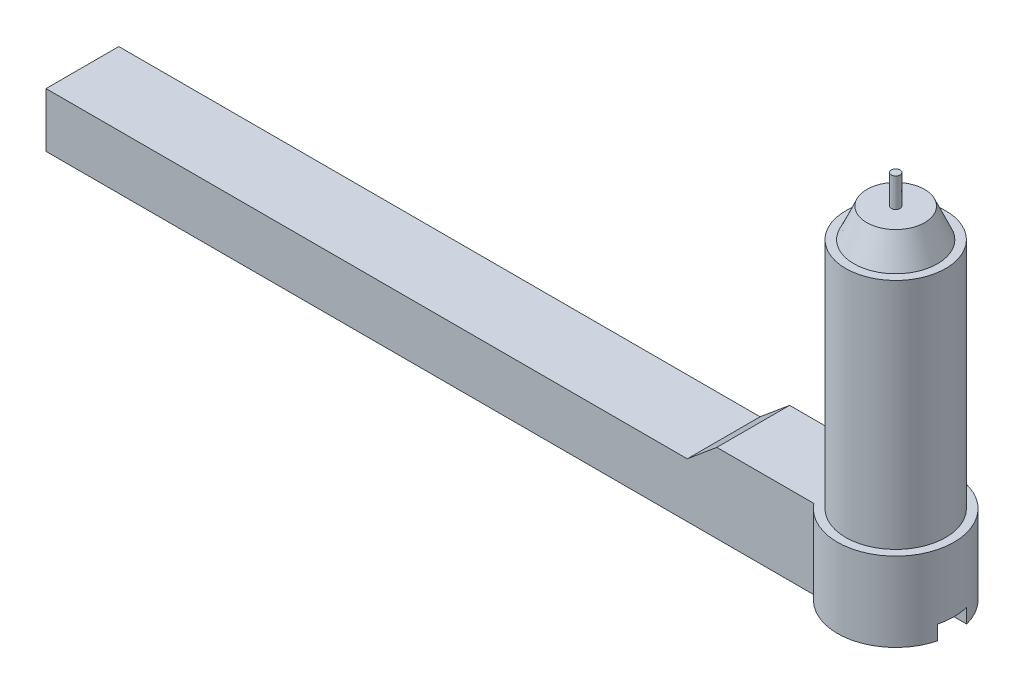
ISO-10303-21;
HEADER;
FILE_DESCRIPTION(('STEP AP214'),'2;1');
FILE_NAME('part.step','',(''),(''),'','','');
FILE_SCHEMA(('AUTOMOTIVE_DESIGN { 1 0 10303 214 1 1 1 1 }'));
ENDSEC;
DATA;
#1=APPLICATION_CONTEXT('core data for automotive mechanical design processes');
#2=APPLICATION_PROTOCOL_DEFINITION('international standard','automotive_design',2000,#1);
#3=PRODUCT_CONTEXT('',#1,'mechanical');
#4=PRODUCT('Part','Part','',(#3));
#5=PRODUCT_RELATED_PRODUCT_CATEGORY('part','',(#4));
#6=PRODUCT_DEFINITION_FORMATION('','',#4);
#7=PRODUCT_DEFINITION_CONTEXT('part definition',#1,'design');
#8=PRODUCT_DEFINITION('design','',#6,#7);
#9=PRODUCT_DEFINITION_SHAPE('','',#8);
#10=(LENGTH_UNIT() NAMED_UNIT(*) SI_UNIT(.MILLI.,.METRE.));
#11=(NAMED_UNIT(*) PLANE_ANGLE_UNIT() SI_UNIT($,.RADIAN.));
#12=(NAMED_UNIT(*) SI_UNIT($,.STERADIAN.) SOLID_ANGLE_UNIT());
#13=UNCERTAINTY_MEASURE_WITH_UNIT(LENGTH_MEASURE(1.E-05),#10,'distance_accuracy_value','');
#14=(GEOMETRIC_REPRESENTATION_CONTEXT(3) GLOBAL_UNCERTAINTY_ASSIGNED_CONTEXT((#13)) GLOBAL_UNIT_ASSIGNED_CONTEXT((#10,
#11,#12)) REPRESENTATION_CONTEXT('',''));
#15=CARTESIAN_POINT('',(0.,0.,0.));
#16=DIRECTION('',(0.,0.,1.));
#17=DIRECTION('',(1.,0.,0.));
#18=AXIS2_PLACEMENT_3D('',#15,#16,#17);
#19=CARTESIAN_POINT('',(-42.6478722443733,9.,-3.80623917297608));
#20=DIRECTION('',(1.,0.,0.));
#21=DIRECTION('',(0.,0.,-1.));
#22=AXIS2_PLACEMENT_3D('',#19,#20,#21);
#23=PLANE('',#22);
#24=DIRECTION('',(0.,-1.,0.));
#25=VECTOR('',#24,1.);
#26=CARTESIAN_POINT('',(-42.6478722443733,9.,-3.80623917297608));
#27=LINE('',#26,#25);
#28=CARTESIAN_POINT('',(-42.6478722443733,7.30493676232652,-3.80623917297608));
#29=VERTEX_POINT('',#28);
#30=CARTESIAN_POINT('',(-42.6478722443733,3.56782360118036,-3.80623917297608));
#31=VERTEX_POINT('',#30);
#32=EDGE_CURVE('E193',#29,#31,#27,.T.);
#33=ORIENTED_EDGE('',*,*,#32,.T.);
#34=DIRECTION('',(0.,0.,1.));
#35=VECTOR('',#34,1.);
#36=CARTESIAN_POINT('',(-42.6478722443733,3.56782360118036,-5.30623917297608));
#37=LINE('',#36,#35);
#38=CARTESIAN_POINT('',(-42.6478722443733,3.56782360118036,1.19376082702392));
#39=VERTEX_POINT('',#38);
#40=EDGE_CURVE('E56',#31,#39,#37,.T.);
#41=ORIENTED_EDGE('',*,*,#40,.T.);
#42=DIRECTION('',(0.,-1.,0.));
#43=VECTOR('',#42,1.);
#44=CARTESIAN_POINT('',(-42.6478722443733,9.,1.19376082702392));
#45=LINE('',#44,#43);
#46=CARTESIAN_POINT('',(-42.6478722443733,7.30493676232652,1.19376082702392));
#47=VERTEX_POINT('',#46);
#48=EDGE_CURVE('E202',#47,#39,#45,.T.);
#49=ORIENTED_EDGE('',*,*,#48,.F.);
#50=DIRECTION('',(0.,0.,1.));
#51=VECTOR('',#50,1.);
#52=CARTESIAN_POINT('',(-42.6478722443733,7.30493676232652,-4.80623917297608));
#53=LINE('',#52,#51);
#54=EDGE_CURVE('E179',#29,#47,#53,.T.);
#55=ORIENTED_EDGE('',*,*,#54,.F.);
#56=EDGE_LOOP('',(#33,#41,#49,#55));
#57=FACE_BOUND('',#56,.T.);
#58=ADVANCED_FACE('F34',(#57),#23,.F.);
#59=CARTESIAN_POINT('',(-42.6478722443733,9.,1.19376082702392));
#60=DIRECTION('',(0.,0.,-1.));
#61=DIRECTION('',(-1.,0.,0.));
#62=AXIS2_PLACEMENT_3D('',#59,#60,#61);
#63=PLANE('',#62);
#64=ORIENTED_EDGE('',*,*,#48,.T.);
#65=DIRECTION('',(1.,0.,0.));
#66=VECTOR('',#65,1.);
#67=CARTESIAN_POINT('',(-42.6478722443733,3.56782360118036,1.19376082702392));
#68=LINE('',#67,#66);
#69=CARTESIAN_POINT('',(10.0914698488453,3.56782360118036,1.19376082702392));
#70=VERTEX_POINT('',#69);
#71=EDGE_CURVE('E152',#39,#70,#68,.T.);
#72=ORIENTED_EDGE('',*,*,#71,.T.);
#73=DIRECTION('',(0.,-1.,0.));
#74=VECTOR('',#73,1.);
#75=CARTESIAN_POINT('',(10.0914698488453,9.,1.19376082702392));
#76=LINE('',#75,#74);
#77=CARTESIAN_POINT('',(10.0914698488453,9.,1.19376082702392));
#78=VERTEX_POINT('',#77);
#79=EDGE_CURVE('E199',#78,#70,#76,.T.);
#80=ORIENTED_EDGE('',*,*,#79,.F.);
#81=DIRECTION('',(1.,0.,0.));
#82=VECTOR('',#81,1.);
#83=CARTESIAN_POINT('',(-42.6478722443733,9.,1.19376082702392));
#84=LINE('',#83,#82);
#85=CARTESIAN_POINT('',(3.42658005695919,9.,1.19376082702392));
#86=VERTEX_POINT('',#85);
#87=EDGE_CURVE('E186',#86,#78,#84,.T.);
#88=ORIENTED_EDGE('',*,*,#87,.F.);
#89=DIRECTION('',(0.767367056910445,0.641208078527244,0.));
#90=VECTOR('',#89,1.);
#91=CARTESIAN_POINT('',(1.39800971991949,7.30493676232652,1.19376082702392));
#92=LINE('',#91,#90);
#93=CARTESIAN_POINT('',(1.39800971991949,7.30493676232652,1.19376082702392));
#94=VERTEX_POINT('',#93);
#95=EDGE_CURVE('E177',#94,#86,#92,.T.);
#96=ORIENTED_EDGE('',*,*,#95,.F.);
#97=DIRECTION('',(1.,0.,0.));
#98=VECTOR('',#97,1.);
#99=CARTESIAN_POINT('',(-42.6478722443733,7.30493676232652,1.19376082702392));
#100=LINE('',#99,#98);
#101=EDGE_CURVE('E171',#47,#94,#100,.T.);
#102=ORIENTED_EDGE('',*,*,#101,.F.);
#103=EDGE_LOOP('',(#64,#72,#80,#88,#96,#102));
#104=FACE_BOUND('',#103,.T.);
#105=ADVANCED_FACE('F222',(#104),#63,.F.);
#106=CARTESIAN_POINT('',(13.2139688480445,9.,-1.30623917297608));
#107=DIRECTION('',(0.,-1.,0.));
#108=DIRECTION('',(0.,0.,-1.));
#109=AXIS2_PLACEMENT_3D('',#106,#107,#108);
#110=CYLINDRICAL_SURFACE('',#109,4.);
#111=CARTESIAN_POINT('',(13.2139688480445,3.56782360118036,-1.30623917297608));
#112=DIRECTION('',(0.,1.,0.));
#113=DIRECTION('',(0.,0.,1.));
#114=AXIS2_PLACEMENT_3D('',#111,#112,#113);
#115=CIRCLE('',#114,4.);
#116=CARTESIAN_POINT('',(17.0869521942519,3.56782360118036,-0.306239172976082));
#117=VERTEX_POINT('',#116);
#118=EDGE_CURVE('E149',#70,#117,#115,.T.);
#119=ORIENTED_EDGE('',*,*,#118,.T.);
#120=DIRECTION('',(0.,-1.,0.));
#121=VECTOR('',#120,1.);
#122=CARTESIAN_POINT('',(17.0869521942519,9.,-0.306239172976082));
#123=LINE('',#122,#121);
#124=CARTESIAN_POINT('',(17.0869521942519,4.56782360118036,-0.306239172976082));
#125=VERTEX_POINT('',#124);
#126=EDGE_CURVE('E139',#117,#125,#123,.F.);
#127=ORIENTED_EDGE('',*,*,#126,.T.);
#128=CARTESIAN_POINT('',(13.2139688480445,4.56782360118036,-1.30623917297608));
#129=DIRECTION('',(0.,1.,0.));
#130=DIRECTION('',(0.,0.,1.));
#131=AXIS2_PLACEMENT_3D('',#128,#129,#130);
#132=CIRCLE('',#131,4.);
#133=CARTESIAN_POINT('',(17.0869521942519,4.56782360118036,-2.30623917297608));
#134=VERTEX_POINT('',#133);
#135=EDGE_CURVE('E11',#125,#134,#132,.T.);
#136=ORIENTED_EDGE('',*,*,#135,.T.);
#137=DIRECTION('',(0.,-1.,0.));
#138=VECTOR('',#137,1.);
#139=CARTESIAN_POINT('',(17.0869521942519,9.,-2.30623917297608));
#140=LINE('',#139,#138);
#141=CARTESIAN_POINT('',(17.0869521942519,3.56782360118036,-2.30623917297608));
#142=VERTEX_POINT('',#141);
#143=EDGE_CURVE('E137',#134,#142,#140,.T.);
#144=ORIENTED_EDGE('',*,*,#143,.T.);
#145=CARTESIAN_POINT('',(10.0914698488453,3.56782360118036,-3.80623917297608));
#146=VERTEX_POINT('',#145);
#147=EDGE_CURVE('E129',#142,#146,#115,.T.);
#148=ORIENTED_EDGE('',*,*,#147,.T.);
#149=DIRECTION('',(0.,-1.,0.));
#150=VECTOR('',#149,1.);
#151=CARTESIAN_POINT('',(10.0914698488453,9.,-3.80623917297608));
#152=LINE('',#151,#150);
#153=CARTESIAN_POINT('',(10.0914698488453,9.,-3.80623917297608));
#154=VERTEX_POINT('',#153);
#155=EDGE_CURVE('E196',#154,#146,#152,.T.);
#156=ORIENTED_EDGE('',*,*,#155,.F.);
#157=CARTESIAN_POINT('',(13.2139688480445,9.,-1.30623917297608));
#158=DIRECTION('',(0.,1.,0.));
#159=DIRECTION('',(0.,0.,1.));
#160=AXIS2_PLACEMENT_3D('',#157,#158,#159);
#161=CIRCLE('',#160,4.);
#162=EDGE_CURVE('E188',#78,#154,#161,.T.);
#163=ORIENTED_EDGE('',*,*,#162,.F.);
#164=ORIENTED_EDGE('',*,*,#79,.T.);
#165=EDGE_LOOP('',(#119,#127,#136,#144,#148,#156,#163,#164));
#166=FACE_BOUND('',#165,.T.);
#167=ADVANCED_FACE('F232',(#166),#110,.T.);
#168=CARTESIAN_POINT('',(-42.6478722443733,9.,-3.80623917297608));
#169=DIRECTION('',(0.,0.,1.));
#170=DIRECTION('',(1.,0.,0.));
#171=AXIS2_PLACEMENT_3D('',#168,#169,#170);
#172=PLANE('',#171);
#173=ORIENTED_EDGE('',*,*,#155,.T.);
#174=DIRECTION('',(-1.,0.,0.));
#175=VECTOR('',#174,1.);
#176=CARTESIAN_POINT('',(-42.6478722443733,3.56782360118036,-3.80623917297608));
#177=LINE('',#176,#175);
#178=EDGE_CURVE('E41',#146,#31,#177,.T.);
#179=ORIENTED_EDGE('',*,*,#178,.T.);
#180=ORIENTED_EDGE('',*,*,#32,.F.);
#181=DIRECTION('',(1.,0.,0.));
#182=VECTOR('',#181,1.);
#183=CARTESIAN_POINT('',(-42.6478722443733,7.30493676232652,-3.80623917297608));
#184=LINE('',#183,#182);
#185=CARTESIAN_POINT('',(1.39800971991949,7.30493676232652,-3.80623917297608));
#186=VERTEX_POINT('',#185);
#187=EDGE_CURVE('E174',#29,#186,#184,.T.);
#188=ORIENTED_EDGE('',*,*,#187,.T.);
#189=DIRECTION('',(0.767367056910446,0.641208078527245,0.));
#190=VECTOR('',#189,1.);
#191=CARTESIAN_POINT('',(-23.7044625459222,-13.6705636359688,-3.80623917297608));
#192=LINE('',#191,#190);
#193=CARTESIAN_POINT('',(3.42658005695919,9.,-3.80623917297608));
#194=VERTEX_POINT('',#193);
#195=EDGE_CURVE('E182',#186,#194,#192,.T.);
#196=ORIENTED_EDGE('',*,*,#195,.T.);
#197=DIRECTION('',(-1.,0.,0.));
#198=VECTOR('',#197,1.);
#199=CARTESIAN_POINT('',(-42.6478722443733,9.,-3.80623917297608));
#200=LINE('',#199,#198);
#201=EDGE_CURVE('E190',#154,#194,#200,.T.);
#202=ORIENTED_EDGE('',*,*,#201,.F.);
#203=EDGE_LOOP('',(#173,#179,#180,#188,#196,#202));
#204=FACE_BOUND('',#203,.T.);
#205=ADVANCED_FACE('F210',(#204),#172,.F.);
#206=CARTESIAN_POINT('',(13.2139688480445,9.,-1.30623917297608));
#207=DIRECTION('',(0.,1.,0.));
#208=DIRECTION('',(0.,0.,1.));
#209=AXIS2_PLACEMENT_3D('',#206,#207,#208);
#210=PLANE('',#209);
#211=CARTESIAN_POINT('',(13.2139688480445,9.,-1.30623917297608));
#212=DIRECTION('',(0.,1.,0.));
#213=DIRECTION('',(0.,0.,1.));
#214=AXIS2_PLACEMENT_3D('',#211,#212,#213);
#215=CIRCLE('',#214,3.43498668710074);
#216=CARTESIAN_POINT('',(13.2139688480445,9.,2.12874751412466));
#217=VERTEX_POINT('',#216);
#218=EDGE_CURVE('E165',#217,#217,#215,.T.);
#219=ORIENTED_EDGE('',*,*,#218,.F.);
#220=EDGE_LOOP('',(#219));
#221=FACE_BOUND('',#220,.T.);
#222=DIRECTION('',(0.,0.,-1.));
#223=VECTOR('',#222,1.);
#224=CARTESIAN_POINT('',(3.42658005695919,9.,-1.30623917297608));
#225=LINE('',#224,#223);
#226=EDGE_CURVE('E205',#86,#194,#225,.T.);
#227=ORIENTED_EDGE('',*,*,#226,.F.);
#228=ORIENTED_EDGE('',*,*,#87,.T.);
#229=ORIENTED_EDGE('',*,*,#162,.T.);
#230=ORIENTED_EDGE('',*,*,#201,.T.);
#231=EDGE_LOOP('',(#227,#228,#229,#230));
#232=FACE_BOUND('',#231,.T.);
#233=ADVANCED_FACE('F229',(#221,#232),#210,.T.);
#234=CARTESIAN_POINT('',(-42.6478722443733,7.30493676232652,-4.80623917297608));
#235=DIRECTION('',(0.,-1.,0.));
#236=DIRECTION('',(0.,0.,-1.));
#237=AXIS2_PLACEMENT_3D('',#234,#235,#236);
#238=PLANE('',#237);
#239=ORIENTED_EDGE('',*,*,#54,.T.);
#240=ORIENTED_EDGE('',*,*,#101,.T.);
#241=DIRECTION('',(0.,0.,1.));
#242=VECTOR('',#241,1.);
#243=CARTESIAN_POINT('',(1.39800971991949,7.30493676232652,-4.80623917297608));
#244=LINE('',#243,#242);
#245=EDGE_CURVE('E180',#186,#94,#244,.T.);
#246=ORIENTED_EDGE('',*,*,#245,.F.);
#247=ORIENTED_EDGE('',*,*,#187,.F.);
#248=EDGE_LOOP('',(#239,#240,#246,#247));
#249=FACE_BOUND('',#248,.T.);
#250=ADVANCED_FACE('F218',(#249),#238,.F.);
#251=CARTESIAN_POINT('',(1.39800971991949,7.30493676232652,-4.80623917297608));
#252=DIRECTION('',(0.641208078527245,-0.767367056910446,0.));
#253=DIRECTION('',(0.767367056910446,0.641208078527245,0.));
#254=AXIS2_PLACEMENT_3D('',#251,#252,#253);
#255=PLANE('',#254);
#256=ORIENTED_EDGE('',*,*,#245,.T.);
#257=ORIENTED_EDGE('',*,*,#95,.T.);
#258=ORIENTED_EDGE('',*,*,#226,.T.);
#259=ORIENTED_EDGE('',*,*,#195,.F.);
#260=EDGE_LOOP('',(#256,#257,#258,#259));
#261=FACE_BOUND('',#260,.T.);
#262=ADVANCED_FACE('F227',(#261),#255,.F.);
#263=CARTESIAN_POINT('',(13.2139688480445,25.,-1.30623917297608));
#264=DIRECTION('',(0.,-1.,0.));
#265=DIRECTION('',(0.,0.,-1.));
#266=AXIS2_PLACEMENT_3D('',#263,#264,#265);
#267=CYLINDRICAL_SURFACE('',#266,3.43498668710074);
#268=CARTESIAN_POINT('',(13.2139688480445,25.,-1.30623917297608));
#269=DIRECTION('',(0.,1.,0.));
#270=DIRECTION('',(0.,0.,1.));
#271=AXIS2_PLACEMENT_3D('',#268,#269,#270);
#272=CIRCLE('',#271,3.43498668710074);
#273=CARTESIAN_POINT('',(13.2139688480445,25.,2.12874751412466));
#274=VERTEX_POINT('',#273);
#275=EDGE_CURVE('E168',#274,#274,#272,.T.);
#276=ORIENTED_EDGE('',*,*,#275,.F.);
#277=EDGE_LOOP('',(#276));
#278=FACE_BOUND('',#277,.T.);
#279=ORIENTED_EDGE('',*,*,#218,.T.);
#280=EDGE_LOOP('',(#279));
#281=FACE_BOUND('',#280,.T.);
#282=ADVANCED_FACE('F268',(#278,#281),#267,.T.);
#283=CARTESIAN_POINT('',(13.2139688480445,25.,-1.30623917297608));
#284=DIRECTION('',(0.,1.,0.));
#285=DIRECTION('',(0.,0.,1.));
#286=AXIS2_PLACEMENT_3D('',#283,#284,#285);
#287=PLANE('',#286);
#288=CARTESIAN_POINT('',(13.2139688480445,25.,-1.30623917297608));
#289=DIRECTION('',(0.,1.,0.));
#290=DIRECTION('',(0.,0.,1.));
#291=AXIS2_PLACEMENT_3D('',#288,#289,#290);
#292=CIRCLE('',#291,2.87274252724851);
#293=CARTESIAN_POINT('',(13.2139688480445,25.,1.56650335427243));
#294=VERTEX_POINT('',#293);
#295=EDGE_CURVE('E162',#294,#294,#292,.T.);
#296=ORIENTED_EDGE('',*,*,#295,.F.);
#297=EDGE_LOOP('',(#296));
#298=FACE_BOUND('',#297,.T.);
#299=ORIENTED_EDGE('',*,*,#275,.T.);
#300=EDGE_LOOP('',(#299));
#301=FACE_BOUND('',#300,.T.);
#302=ADVANCED_FACE('F271',(#298,#301),#287,.T.);
#303=CARTESIAN_POINT('',(13.2139688480445,25.,-1.30623917297608));
#304=DIRECTION('',(0.,-1.,0.));
#305=DIRECTION('',(0.,0.,1.));
#306=AXIS2_PLACEMENT_3D('',#303,#304,#305);
#307=CONICAL_SURFACE('',#306,2.87274252724851,0.418879020478639);
#308=CARTESIAN_POINT('',(13.2139688480445,27.,-1.30623917297608));
#309=DIRECTION('',(0.,1.,0.));
#310=DIRECTION('',(0.,0.,1.));
#311=AXIS2_PLACEMENT_3D('',#308,#309,#310);
#312=CIRCLE('',#311,1.98228515663143);
#313=CARTESIAN_POINT('',(13.2139688480445,27.,0.676045983655354));
#314=VERTEX_POINT('',#313);
#315=EDGE_CURVE('E158',#314,#314,#312,.T.);
#316=ORIENTED_EDGE('',*,*,#315,.F.);
#317=EDGE_LOOP('',(#316));
#318=FACE_BOUND('',#317,.T.);
#319=ORIENTED_EDGE('',*,*,#295,.T.);
#320=EDGE_LOOP('',(#319));
#321=FACE_BOUND('',#320,.T.);
#322=ADVANCED_FACE('F275',(#318,#321),#307,.T.);
#323=CARTESIAN_POINT('',(13.2139688480445,27.,-1.30623917297608));
#324=DIRECTION('',(0.,1.,0.));
#325=DIRECTION('',(0.,0.,1.));
#326=AXIS2_PLACEMENT_3D('',#323,#324,#325);
#327=PLANE('',#326);
#328=CARTESIAN_POINT('',(13.2139688480445,27.,-1.30623917297608));
#329=DIRECTION('',(0.,1.,0.));
#330=DIRECTION('',(0.,0.,1.));
#331=AXIS2_PLACEMENT_3D('',#328,#329,#330);
#332=CIRCLE('',#331,0.3);
#333=CARTESIAN_POINT('',(13.2139688480445,27.,-1.00623917297608));
#334=VERTEX_POINT('',#333);
#335=EDGE_CURVE('E159',#334,#334,#332,.T.);
#336=ORIENTED_EDGE('',*,*,#335,.F.);
#337=EDGE_LOOP('',(#336));
#338=FACE_BOUND('',#337,.T.);
#339=ORIENTED_EDGE('',*,*,#315,.T.);
#340=EDGE_LOOP('',(#339));
#341=FACE_BOUND('',#340,.T.);
#342=ADVANCED_FACE('F279',(#338,#341),#327,.T.);
#343=CARTESIAN_POINT('',(13.2139688480445,29.,-1.30623917297608));
#344=DIRECTION('',(0.,-1.,0.));
#345=DIRECTION('',(0.,0.,-1.));
#346=AXIS2_PLACEMENT_3D('',#343,#344,#345);
#347=CYLINDRICAL_SURFACE('',#346,0.3);
#348=CARTESIAN_POINT('',(13.2139688480445,29.,-1.30623917297608));
#349=DIRECTION('',(0.,1.,0.));
#350=DIRECTION('',(0.,0.,1.));
#351=AXIS2_PLACEMENT_3D('',#348,#349,#350);
#352=CIRCLE('',#351,0.3);
#353=CARTESIAN_POINT('',(13.2139688480445,29.,-1.00623917297608));
#354=VERTEX_POINT('',#353);
#355=EDGE_CURVE('E155',#354,#354,#352,.T.);
#356=ORIENTED_EDGE('',*,*,#355,.F.);
#357=EDGE_LOOP('',(#356));
#358=FACE_BOUND('',#357,.T.);
#359=ORIENTED_EDGE('',*,*,#335,.T.);
#360=EDGE_LOOP('',(#359));
#361=FACE_BOUND('',#360,.T.);
#362=ADVANCED_FACE('F283',(#358,#361),#347,.T.);
#363=CARTESIAN_POINT('',(13.2139688480445,29.,-1.30623917297608));
#364=DIRECTION('',(0.,1.,0.));
#365=DIRECTION('',(0.,0.,1.));
#366=AXIS2_PLACEMENT_3D('',#363,#364,#365);
#367=PLANE('',#366);
#368=ORIENTED_EDGE('',*,*,#355,.T.);
#369=EDGE_LOOP('',(#368));
#370=FACE_BOUND('',#369,.T.);
#371=ADVANCED_FACE('F287',(#370),#367,.T.);
#372=CARTESIAN_POINT('',(-42.6478722443733,3.56782360118036,-5.30623917297608));
#373=DIRECTION('',(0.,1.,0.));
#374=DIRECTION('',(0.,0.,1.));
#375=AXIS2_PLACEMENT_3D('',#372,#373,#374);
#376=PLANE('',#375);
#377=CARTESIAN_POINT('',(-39.220113289862,3.56782360118036,-1.30623917297608));
#378=DIRECTION('',(0.,-1.,0.));
#379=DIRECTION('',(0.,0.,-1.));
#380=AXIS2_PLACEMENT_3D('',#377,#378,#379);
#381=CIRCLE('',#380,0.999999999999998);
#382=CARTESIAN_POINT('',(-39.220113289862,3.56782360118036,-2.30623917297608));
#383=VERTEX_POINT('',#382);
#384=EDGE_CURVE('E142',#383,#383,#381,.T.);
#385=ORIENTED_EDGE('',*,*,#384,.F.);
#386=EDGE_LOOP('',(#385));
#387=FACE_BOUND('',#386,.T.);
#388=DIRECTION('',(0.,0.,-1.));
#389=VECTOR('',#388,1.);
#390=CARTESIAN_POINT('',(15.9999,3.56782360118036,-0.306239172976082));
#391=LINE('',#390,#389);
#392=CARTESIAN_POINT('',(15.9999,3.56782360118036,-0.306239172976081));
#393=VERTEX_POINT('',#392);
#394=CARTESIAN_POINT('',(15.9999,3.56782360118036,-2.30623917297608));
#395=VERTEX_POINT('',#394);
#396=EDGE_CURVE('E121',#393,#395,#391,.T.);
#397=ORIENTED_EDGE('',*,*,#396,.F.);
#398=DIRECTION('',(1.,0.,0.));
#399=VECTOR('',#398,1.);
#400=CARTESIAN_POINT('',(15.9999,3.56782360118036,-0.306239172976082));
#401=LINE('',#400,#399);
#402=EDGE_CURVE('E130',#393,#117,#401,.T.);
#403=ORIENTED_EDGE('',*,*,#402,.T.);
#404=ORIENTED_EDGE('',*,*,#118,.F.);
#405=ORIENTED_EDGE('',*,*,#71,.F.);
#406=ORIENTED_EDGE('',*,*,#40,.F.);
#407=ORIENTED_EDGE('',*,*,#178,.F.);
#408=ORIENTED_EDGE('',*,*,#147,.F.);
#409=DIRECTION('',(1.,0.,0.));
#410=VECTOR('',#409,1.);
#411=CARTESIAN_POINT('',(15.9999,3.56782360118036,-2.30623917297608));
#412=LINE('',#411,#410);
#413=EDGE_CURVE('E115',#395,#142,#412,.T.);
#414=ORIENTED_EDGE('',*,*,#413,.F.);
#415=EDGE_LOOP('',(#397,#403,#404,#405,#406,#407,#408,#414));
#416=FACE_BOUND('',#415,.T.);
#417=ADVANCED_FACE('F128',(#387,#416),#376,.F.);
#418=CARTESIAN_POINT('',(-39.220113289862,6.56782360118036,-1.30623917297608));
#419=DIRECTION('',(0.,-1.,0.));
#420=DIRECTION('',(0.,0.,-1.));
#421=AXIS2_PLACEMENT_3D('',#418,#419,#420);
#422=CYLINDRICAL_SURFACE('',#421,0.999999999999998);
#423=CARTESIAN_POINT('',(-39.220113289862,6.56782360118036,-1.30623917297608));
#424=DIRECTION('',(0.,-1.,0.));
#425=DIRECTION('',(0.,0.,-1.));
#426=AXIS2_PLACEMENT_3D('',#423,#424,#425);
#427=CIRCLE('',#426,0.999999999999998);
#428=CARTESIAN_POINT('',(-39.220113289862,6.56782360118036,-2.30623917297608));
#429=VERTEX_POINT('',#428);
#430=EDGE_CURVE('E143',#429,#429,#427,.T.);
#431=ORIENTED_EDGE('',*,*,#430,.F.);
#432=EDGE_LOOP('',(#431));
#433=FACE_BOUND('',#432,.T.);
#434=ORIENTED_EDGE('',*,*,#384,.T.);
#435=EDGE_LOOP('',(#434));
#436=FACE_BOUND('',#435,.T.);
#437=ADVANCED_FACE('F294',(#433,#436),#422,.F.);
#438=CARTESIAN_POINT('',(-39.220113289862,6.56782360118036,-1.30623917297608));
#439=DIRECTION('',(0.,-1.,0.));
#440=DIRECTION('',(0.,0.,-1.));
#441=AXIS2_PLACEMENT_3D('',#438,#439,#440);
#442=PLANE('',#441);
#443=ORIENTED_EDGE('',*,*,#430,.T.);
#444=EDGE_LOOP('',(#443));
#445=FACE_BOUND('',#444,.T.);
#446=ADVANCED_FACE('F247',(#445),#442,.T.);
#447=CARTESIAN_POINT('',(15.9999,4.56782360118036,-0.306239172976082));
#448=DIRECTION('',(0.,1.,0.));
#449=DIRECTION('',(0.,0.,1.));
#450=AXIS2_PLACEMENT_3D('',#447,#448,#449);
#451=PLANE('',#450);
#452=DIRECTION('',(1.,0.,0.));
#453=VECTOR('',#452,1.);
#454=CARTESIAN_POINT('',(15.9999,4.56782360118036,-0.306239172976082));
#455=LINE('',#454,#453);
#456=CARTESIAN_POINT('',(15.9999,4.56782360118036,-0.306239172976082));
#457=VERTEX_POINT('',#456);
#458=EDGE_CURVE('E132',#457,#125,#455,.T.);
#459=ORIENTED_EDGE('',*,*,#458,.F.);
#460=DIRECTION('',(0.,0.,1.));
#461=VECTOR('',#460,1.);
#462=CARTESIAN_POINT('',(15.9999,4.56782360118036,-0.306239172976082));
#463=LINE('',#462,#461);
#464=CARTESIAN_POINT('',(15.9999,4.56782360118036,-2.30623917297608));
#465=VERTEX_POINT('',#464);
#466=EDGE_CURVE('E120',#465,#457,#463,.T.);
#467=ORIENTED_EDGE('',*,*,#466,.F.);
#468=DIRECTION('',(1.,0.,0.));
#469=VECTOR('',#468,1.);
#470=CARTESIAN_POINT('',(15.9999,4.56782360118036,-2.30623917297608));
#471=LINE('',#470,#469);
#472=EDGE_CURVE('E118',#465,#134,#471,.T.);
#473=ORIENTED_EDGE('',*,*,#472,.T.);
#474=ORIENTED_EDGE('',*,*,#135,.F.);
#475=EDGE_LOOP('',(#459,#467,#473,#474));
#476=FACE_BOUND('',#475,.T.);
#477=ADVANCED_FACE('F234',(#476),#451,.F.);
#478=CARTESIAN_POINT('',(15.9999,3.56782360118036,-0.306239172976082));
#479=DIRECTION('',(0.,0.,1.));
#480=DIRECTION('',(1.,0.,0.));
#481=AXIS2_PLACEMENT_3D('',#478,#479,#480);
#482=PLANE('',#481);
#483=ORIENTED_EDGE('',*,*,#402,.F.);
#484=DIRECTION('',(0.,-1.,0.));
#485=VECTOR('',#484,1.);
#486=CARTESIAN_POINT('',(15.9999,3.56782360118036,-0.306239172976082));
#487=LINE('',#486,#485);
#488=EDGE_CURVE('E48',#457,#393,#487,.T.);
#489=ORIENTED_EDGE('',*,*,#488,.F.);
#490=ORIENTED_EDGE('',*,*,#458,.T.);
#491=ORIENTED_EDGE('',*,*,#126,.F.);
#492=EDGE_LOOP('',(#483,#489,#490,#491));
#493=FACE_BOUND('',#492,.T.);
#494=ADVANCED_FACE('F238',(#493),#482,.F.);
#495=CARTESIAN_POINT('',(15.9999,3.56782360118036,-2.30623917297608));
#496=DIRECTION('',(0.,0.,-1.));
#497=DIRECTION('',(-1.,0.,0.));
#498=AXIS2_PLACEMENT_3D('',#495,#496,#497);
#499=PLANE('',#498);
#500=ORIENTED_EDGE('',*,*,#472,.F.);
#501=DIRECTION('',(0.,1.,0.));
#502=VECTOR('',#501,1.);
#503=CARTESIAN_POINT('',(15.9999,3.56782360118036,-2.30623917297608));
#504=LINE('',#503,#502);
#505=EDGE_CURVE('E112',#395,#465,#504,.T.);
#506=ORIENTED_EDGE('',*,*,#505,.F.);
#507=ORIENTED_EDGE('',*,*,#413,.T.);
#508=ORIENTED_EDGE('',*,*,#143,.F.);
#509=EDGE_LOOP('',(#500,#506,#507,#508));
#510=FACE_BOUND('',#509,.T.);
#511=ADVANCED_FACE('F113',(#510),#499,.F.);
#512=CARTESIAN_POINT('',(15.9999,0.,0.));
#513=DIRECTION('',(-1.,0.,0.));
#514=DIRECTION('',(0.,0.,1.));
#515=AXIS2_PLACEMENT_3D('',#512,#513,#514);
#516=PLANE('',#515);
#517=ORIENTED_EDGE('',*,*,#488,.T.);
#518=ORIENTED_EDGE('',*,*,#396,.T.);
#519=ORIENTED_EDGE('',*,*,#505,.T.);
#520=ORIENTED_EDGE('',*,*,#466,.T.);
#521=EDGE_LOOP('',(#517,#518,#519,#520));
#522=FACE_BOUND('',#521,.T.);
#523=ADVANCED_FACE('F124',(#522),#516,.F.);
#524=CLOSED_SHELL('',(#58,#105,#167,#205,#233,#250,#262,#282,#302,#322,#342,#362,#371,#417,#437,
#446,#477,#494,#511,#523));
#525=MANIFOLD_SOLID_BREP('B2',#524);
#526=ADVANCED_BREP_SHAPE_REPRESENTATION('',(#18,#525),#14);
#527=SHAPE_DEFINITION_REPRESENTATION(#9,#526);
ENDSEC;
END-ISO-10303-21;
